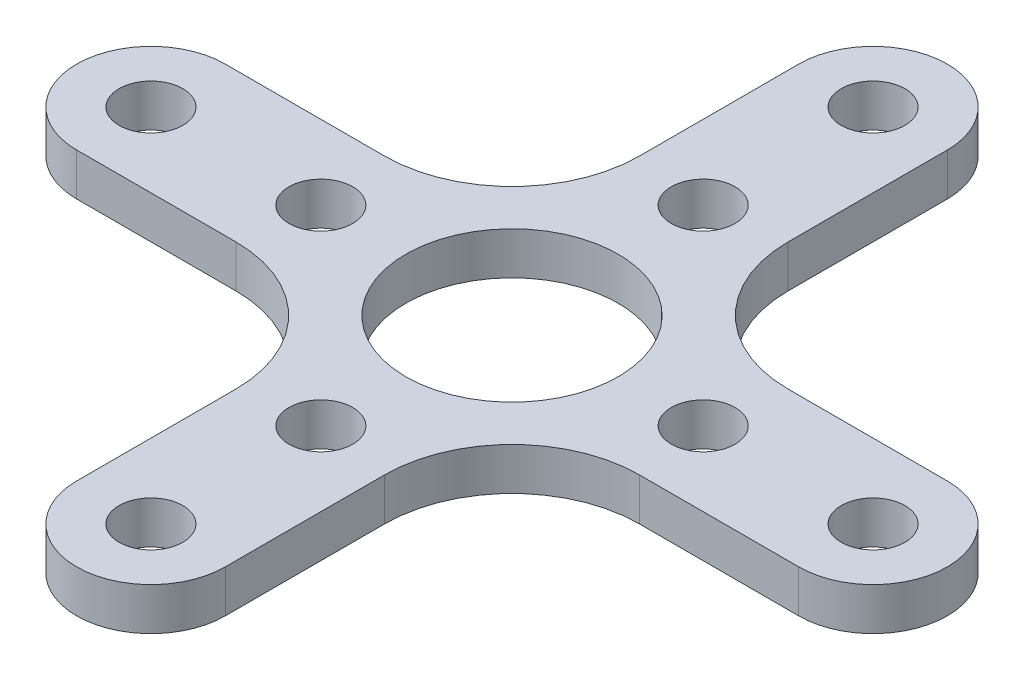
ISO-10303-21;
HEADER;
FILE_DESCRIPTION(('STEP AP214'),'2;1');
FILE_NAME('part.step','',(''),(''),'','','');
FILE_SCHEMA(('AUTOMOTIVE_DESIGN { 1 0 10303 214 1 1 1 1 }'));
ENDSEC;
DATA;
#1=APPLICATION_CONTEXT('core data for automotive mechanical design processes');
#2=APPLICATION_PROTOCOL_DEFINITION('international standard','automotive_design',2000,#1);
#3=PRODUCT_CONTEXT('',#1,'mechanical');
#4=PRODUCT('Part','Part','',(#3));
#5=PRODUCT_RELATED_PRODUCT_CATEGORY('part','',(#4));
#6=PRODUCT_DEFINITION_FORMATION('','',#4);
#7=PRODUCT_DEFINITION_CONTEXT('part definition',#1,'design');
#8=PRODUCT_DEFINITION('design','',#6,#7);
#9=PRODUCT_DEFINITION_SHAPE('','',#8);
#10=(LENGTH_UNIT() NAMED_UNIT(*) SI_UNIT(.MILLI.,.METRE.));
#11=(NAMED_UNIT(*) PLANE_ANGLE_UNIT() SI_UNIT($,.RADIAN.));
#12=(NAMED_UNIT(*) SI_UNIT($,.STERADIAN.) SOLID_ANGLE_UNIT());
#13=UNCERTAINTY_MEASURE_WITH_UNIT(LENGTH_MEASURE(1.E-05),#10,'distance_accuracy_value','');
#14=(GEOMETRIC_REPRESENTATION_CONTEXT(3) GLOBAL_UNCERTAINTY_ASSIGNED_CONTEXT((#13)) GLOBAL_UNIT_ASSIGNED_CONTEXT((#10,
#11,#12)) REPRESENTATION_CONTEXT('',''));
#15=CARTESIAN_POINT('',(0.,0.,0.));
#16=DIRECTION('',(0.,0.,1.));
#17=DIRECTION('',(1.,0.,0.));
#18=AXIS2_PLACEMENT_3D('',#15,#16,#17);
#19=CARTESIAN_POINT('',(17.,2.,0.));
#20=DIRECTION('',(0.,-1.,0.));
#21=DIRECTION('',(0.,0.,-1.));
#22=AXIS2_PLACEMENT_3D('',#19,#20,#21);
#23=CYLINDRICAL_SURFACE('',#22,3.5);
#24=CARTESIAN_POINT('',(17.,0.,0.));
#25=DIRECTION('',(0.,1.,0.));
#26=DIRECTION('',(0.,0.,-1.));
#27=AXIS2_PLACEMENT_3D('',#24,#25,#26);
#28=CIRCLE('',#27,3.5);
#29=CARTESIAN_POINT('',(17.,0.,3.5));
#30=VERTEX_POINT('',#29);
#31=CARTESIAN_POINT('',(17.,0.,-3.5));
#32=VERTEX_POINT('',#31);
#33=EDGE_CURVE('E188',#30,#32,#28,.T.);
#34=ORIENTED_EDGE('',*,*,#33,.T.);
#35=DIRECTION('',(0.,-1.,0.));
#36=VECTOR('',#35,1.);
#37=CARTESIAN_POINT('',(17.,2.,-3.5));
#38=LINE('',#37,#36);
#39=CARTESIAN_POINT('',(17.,2.,-3.5));
#40=VERTEX_POINT('',#39);
#41=EDGE_CURVE('E11',#40,#32,#38,.T.);
#42=ORIENTED_EDGE('',*,*,#41,.F.);
#43=CARTESIAN_POINT('',(17.,2.,0.));
#44=DIRECTION('',(0.,1.,0.));
#45=DIRECTION('',(0.,0.,-1.));
#46=AXIS2_PLACEMENT_3D('',#43,#44,#45);
#47=CIRCLE('',#46,3.5);
#48=CARTESIAN_POINT('',(17.,2.,3.5));
#49=VERTEX_POINT('',#48);
#50=EDGE_CURVE('E219',#49,#40,#47,.T.);
#51=ORIENTED_EDGE('',*,*,#50,.F.);
#52=DIRECTION('',(0.,-1.,0.));
#53=VECTOR('',#52,1.);
#54=CARTESIAN_POINT('',(17.,2.,3.5));
#55=LINE('',#54,#53);
#56=EDGE_CURVE('E184',#49,#30,#55,.T.);
#57=ORIENTED_EDGE('',*,*,#56,.T.);
#58=EDGE_LOOP('',(#34,#42,#51,#57));
#59=FACE_BOUND('',#58,.T.);
#60=ADVANCED_FACE('F44',(#59),#23,.T.);
#61=CARTESIAN_POINT('',(9.50000000000003,2.,-3.49999999999997));
#62=DIRECTION('',(0.,0.,1.));
#63=DIRECTION('',(1.,0.,0.));
#64=AXIS2_PLACEMENT_3D('',#61,#62,#63);
#65=PLANE('',#64);
#66=DIRECTION('',(-1.,0.,0.));
#67=VECTOR('',#66,1.);
#68=CARTESIAN_POINT('',(9.50000000000003,0.,-3.49999999999997));
#69=LINE('',#68,#67);
#70=CARTESIAN_POINT('',(9.50000000000003,0.,-3.49999999999997));
#71=VERTEX_POINT('',#70);
#72=EDGE_CURVE('E191',#32,#71,#69,.T.);
#73=ORIENTED_EDGE('',*,*,#72,.T.);
#74=DIRECTION('',(0.,-1.,0.));
#75=VECTOR('',#74,1.);
#76=CARTESIAN_POINT('',(9.50000000000003,2.,-3.49999999999997));
#77=LINE('',#76,#75);
#78=CARTESIAN_POINT('',(9.50000000000003,2.,-3.49999999999997));
#79=VERTEX_POINT('',#78);
#80=EDGE_CURVE('E52',#79,#71,#77,.T.);
#81=ORIENTED_EDGE('',*,*,#80,.F.);
#82=DIRECTION('',(-1.,0.,0.));
#83=VECTOR('',#82,1.);
#84=CARTESIAN_POINT('',(9.50000000000003,2.,-3.49999999999997));
#85=LINE('',#84,#83);
#86=EDGE_CURVE('E127',#40,#79,#85,.T.);
#87=ORIENTED_EDGE('',*,*,#86,.F.);
#88=ORIENTED_EDGE('',*,*,#41,.T.);
#89=EDGE_LOOP('',(#73,#81,#87,#88));
#90=FACE_BOUND('',#89,.T.);
#91=ADVANCED_FACE('F318',(#90),#65,.F.);
#92=CARTESIAN_POINT('',(9.50000000000004,2.,-9.49999999999998));
#93=DIRECTION('',(0.,-1.,0.));
#94=DIRECTION('',(0.,0.,-1.));
#95=AXIS2_PLACEMENT_3D('',#92,#93,#94);
#96=CYLINDRICAL_SURFACE('',#95,6.00000000000001);
#97=CARTESIAN_POINT('',(9.50000000000004,0.,-9.49999999999998));
#98=DIRECTION('',(0.,-1.,0.));
#99=DIRECTION('',(0.,0.,1.));
#100=AXIS2_PLACEMENT_3D('',#97,#98,#99);
#101=CIRCLE('',#100,6.00000000000001);
#102=CARTESIAN_POINT('',(3.50000000000003,0.,-9.49999999999999));
#103=VERTEX_POINT('',#102);
#104=EDGE_CURVE('E194',#71,#103,#101,.T.);
#105=ORIENTED_EDGE('',*,*,#104,.T.);
#106=DIRECTION('',(0.,-1.,0.));
#107=VECTOR('',#106,1.);
#108=CARTESIAN_POINT('',(3.50000000000003,2.,-9.49999999999999));
#109=LINE('',#108,#107);
#110=CARTESIAN_POINT('',(3.50000000000003,2.,-9.49999999999999));
#111=VERTEX_POINT('',#110);
#112=EDGE_CURVE('E250',#111,#103,#109,.T.);
#113=ORIENTED_EDGE('',*,*,#112,.F.);
#114=CARTESIAN_POINT('',(9.50000000000004,2.,-9.49999999999998));
#115=DIRECTION('',(0.,-1.,0.));
#116=DIRECTION('',(0.,0.,1.));
#117=AXIS2_PLACEMENT_3D('',#114,#115,#116);
#118=CIRCLE('',#117,6.00000000000001);
#119=EDGE_CURVE('E258',#79,#111,#118,.T.);
#120=ORIENTED_EDGE('',*,*,#119,.F.);
#121=ORIENTED_EDGE('',*,*,#80,.T.);
#122=EDGE_LOOP('',(#105,#113,#120,#121));
#123=FACE_BOUND('',#122,.T.);
#124=ADVANCED_FACE('F256',(#123),#96,.F.);
#125=CARTESIAN_POINT('',(3.49999999999999,2.,-17.));
#126=DIRECTION('',(-1.,0.,0.));
#127=DIRECTION('',(0.,0.,1.));
#128=AXIS2_PLACEMENT_3D('',#125,#126,#127);
#129=PLANE('',#128);
#130=DIRECTION('',(0.,0.,-1.));
#131=VECTOR('',#130,1.);
#132=CARTESIAN_POINT('',(3.49999999999999,0.,-17.));
#133=LINE('',#132,#131);
#134=CARTESIAN_POINT('',(3.49999999999999,0.,-17.));
#135=VERTEX_POINT('',#134);
#136=EDGE_CURVE('E196',#103,#135,#133,.T.);
#137=ORIENTED_EDGE('',*,*,#136,.T.);
#138=DIRECTION('',(0.,-1.,0.));
#139=VECTOR('',#138,1.);
#140=CARTESIAN_POINT('',(3.49999999999999,2.,-17.));
#141=LINE('',#140,#139);
#142=CARTESIAN_POINT('',(3.49999999999999,2.,-17.));
#143=VERTEX_POINT('',#142);
#144=EDGE_CURVE('E247',#143,#135,#141,.T.);
#145=ORIENTED_EDGE('',*,*,#144,.F.);
#146=DIRECTION('',(0.,0.,-1.));
#147=VECTOR('',#146,1.);
#148=CARTESIAN_POINT('',(3.49999999999999,2.,-17.));
#149=LINE('',#148,#147);
#150=EDGE_CURVE('E276',#111,#143,#149,.T.);
#151=ORIENTED_EDGE('',*,*,#150,.F.);
#152=ORIENTED_EDGE('',*,*,#112,.T.);
#153=EDGE_LOOP('',(#137,#145,#151,#152));
#154=FACE_BOUND('',#153,.T.);
#155=ADVANCED_FACE('F267',(#154),#129,.F.);
#156=CARTESIAN_POINT('',(0.,2.,-17.));
#157=DIRECTION('',(0.,-1.,0.));
#158=DIRECTION('',(0.,0.,-1.));
#159=AXIS2_PLACEMENT_3D('',#156,#157,#158);
#160=CYLINDRICAL_SURFACE('',#159,3.5);
#161=CARTESIAN_POINT('',(0.,0.,-17.));
#162=DIRECTION('',(0.,1.,0.));
#163=DIRECTION('',(0.,0.,-1.));
#164=AXIS2_PLACEMENT_3D('',#161,#162,#163);
#165=CIRCLE('',#164,3.5);
#166=CARTESIAN_POINT('',(-3.5,0.,-17.));
#167=VERTEX_POINT('',#166);
#168=EDGE_CURVE('E198',#135,#167,#165,.T.);
#169=ORIENTED_EDGE('',*,*,#168,.T.);
#170=DIRECTION('',(0.,-1.,0.));
#171=VECTOR('',#170,1.);
#172=CARTESIAN_POINT('',(-3.5,2.,-17.));
#173=LINE('',#172,#171);
#174=CARTESIAN_POINT('',(-3.5,2.,-17.));
#175=VERTEX_POINT('',#174);
#176=EDGE_CURVE('E244',#175,#167,#173,.T.);
#177=ORIENTED_EDGE('',*,*,#176,.F.);
#178=CARTESIAN_POINT('',(0.,2.,-17.));
#179=DIRECTION('',(0.,1.,0.));
#180=DIRECTION('',(0.,0.,-1.));
#181=AXIS2_PLACEMENT_3D('',#178,#179,#180);
#182=CIRCLE('',#181,3.5);
#183=EDGE_CURVE('E273',#143,#175,#182,.T.);
#184=ORIENTED_EDGE('',*,*,#183,.F.);
#185=ORIENTED_EDGE('',*,*,#144,.T.);
#186=EDGE_LOOP('',(#169,#177,#184,#185));
#187=FACE_BOUND('',#186,.T.);
#188=ADVANCED_FACE('F271',(#187),#160,.T.);
#189=CARTESIAN_POINT('',(-3.5,2.,-17.));
#190=DIRECTION('',(1.,0.,0.));
#191=DIRECTION('',(0.,0.,-1.));
#192=AXIS2_PLACEMENT_3D('',#189,#190,#191);
#193=PLANE('',#192);
#194=DIRECTION('',(0.,0.,1.));
#195=VECTOR('',#194,1.);
#196=CARTESIAN_POINT('',(-3.5,0.,-17.));
#197=LINE('',#196,#195);
#198=CARTESIAN_POINT('',(-3.5,0.,-9.50000000000002));
#199=VERTEX_POINT('',#198);
#200=EDGE_CURVE('E200',#167,#199,#197,.T.);
#201=ORIENTED_EDGE('',*,*,#200,.T.);
#202=DIRECTION('',(0.,-1.,0.));
#203=VECTOR('',#202,1.);
#204=CARTESIAN_POINT('',(-3.5,2.,-9.50000000000002));
#205=LINE('',#204,#203);
#206=CARTESIAN_POINT('',(-3.5,2.,-9.50000000000002));
#207=VERTEX_POINT('',#206);
#208=EDGE_CURVE('E241',#207,#199,#205,.T.);
#209=ORIENTED_EDGE('',*,*,#208,.F.);
#210=DIRECTION('',(0.,0.,1.));
#211=VECTOR('',#210,1.);
#212=CARTESIAN_POINT('',(-3.5,2.,-17.));
#213=LINE('',#212,#211);
#214=EDGE_CURVE('E275',#175,#207,#213,.T.);
#215=ORIENTED_EDGE('',*,*,#214,.F.);
#216=ORIENTED_EDGE('',*,*,#176,.T.);
#217=EDGE_LOOP('',(#201,#209,#215,#216));
#218=FACE_BOUND('',#217,.T.);
#219=ADVANCED_FACE('F331',(#218),#193,.F.);
#220=CARTESIAN_POINT('',(-9.50000000000001,2.,-9.50000000000001));
#221=DIRECTION('',(0.,-1.,0.));
#222=DIRECTION('',(0.,0.,-1.));
#223=AXIS2_PLACEMENT_3D('',#220,#221,#222);
#224=CYLINDRICAL_SURFACE('',#223,6.00000000000001);
#225=CARTESIAN_POINT('',(-9.50000000000001,0.,-9.50000000000001));
#226=DIRECTION('',(0.,-1.,0.));
#227=DIRECTION('',(0.,0.,1.));
#228=AXIS2_PLACEMENT_3D('',#225,#226,#227);
#229=CIRCLE('',#228,6.00000000000001);
#230=CARTESIAN_POINT('',(-9.5,0.,-3.5));
#231=VERTEX_POINT('',#230);
#232=EDGE_CURVE('E202',#199,#231,#229,.T.);
#233=ORIENTED_EDGE('',*,*,#232,.T.);
#234=DIRECTION('',(0.,-1.,0.));
#235=VECTOR('',#234,1.);
#236=CARTESIAN_POINT('',(-9.5,2.,-3.5));
#237=LINE('',#236,#235);
#238=CARTESIAN_POINT('',(-9.5,2.,-3.5));
#239=VERTEX_POINT('',#238);
#240=EDGE_CURVE('E238',#239,#231,#237,.T.);
#241=ORIENTED_EDGE('',*,*,#240,.F.);
#242=CARTESIAN_POINT('',(-9.50000000000001,2.,-9.50000000000001));
#243=DIRECTION('',(0.,-1.,0.));
#244=DIRECTION('',(0.,0.,1.));
#245=AXIS2_PLACEMENT_3D('',#242,#243,#244);
#246=CIRCLE('',#245,6.00000000000001);
#247=EDGE_CURVE('E278',#207,#239,#246,.T.);
#248=ORIENTED_EDGE('',*,*,#247,.F.);
#249=ORIENTED_EDGE('',*,*,#208,.T.);
#250=EDGE_LOOP('',(#233,#241,#248,#249));
#251=FACE_BOUND('',#250,.T.);
#252=ADVANCED_FACE('F334',(#251),#224,.F.);
#253=CARTESIAN_POINT('',(-17.,2.,-3.5));
#254=DIRECTION('',(0.,0.,1.));
#255=DIRECTION('',(1.,0.,0.));
#256=AXIS2_PLACEMENT_3D('',#253,#254,#255);
#257=PLANE('',#256);
#258=DIRECTION('',(-1.,0.,0.));
#259=VECTOR('',#258,1.);
#260=CARTESIAN_POINT('',(-17.,0.,-3.5));
#261=LINE('',#260,#259);
#262=CARTESIAN_POINT('',(-17.,0.,-3.5));
#263=VERTEX_POINT('',#262);
#264=EDGE_CURVE('E204',#231,#263,#261,.T.);
#265=ORIENTED_EDGE('',*,*,#264,.T.);
#266=DIRECTION('',(0.,-1.,0.));
#267=VECTOR('',#266,1.);
#268=CARTESIAN_POINT('',(-17.,2.,-3.5));
#269=LINE('',#268,#267);
#270=CARTESIAN_POINT('',(-17.,2.,-3.5));
#271=VERTEX_POINT('',#270);
#272=EDGE_CURVE('E235',#271,#263,#269,.T.);
#273=ORIENTED_EDGE('',*,*,#272,.F.);
#274=DIRECTION('',(-1.,0.,0.));
#275=VECTOR('',#274,1.);
#276=CARTESIAN_POINT('',(-17.,2.,-3.5));
#277=LINE('',#276,#275);
#278=EDGE_CURVE('E284',#239,#271,#277,.T.);
#279=ORIENTED_EDGE('',*,*,#278,.F.);
#280=ORIENTED_EDGE('',*,*,#240,.T.);
#281=EDGE_LOOP('',(#265,#273,#279,#280));
#282=FACE_BOUND('',#281,.T.);
#283=ADVANCED_FACE('F338',(#282),#257,.F.);
#284=CARTESIAN_POINT('',(-17.,2.,0.));
#285=DIRECTION('',(0.,-1.,0.));
#286=DIRECTION('',(0.,0.,-1.));
#287=AXIS2_PLACEMENT_3D('',#284,#285,#286);
#288=CYLINDRICAL_SURFACE('',#287,3.5);
#289=CARTESIAN_POINT('',(-17.,0.,0.));
#290=DIRECTION('',(0.,1.,0.));
#291=DIRECTION('',(0.,0.,1.));
#292=AXIS2_PLACEMENT_3D('',#289,#290,#291);
#293=CIRCLE('',#292,3.5);
#294=CARTESIAN_POINT('',(-17.,0.,3.5));
#295=VERTEX_POINT('',#294);
#296=EDGE_CURVE('E206',#263,#295,#293,.T.);
#297=ORIENTED_EDGE('',*,*,#296,.T.);
#298=DIRECTION('',(0.,-1.,0.));
#299=VECTOR('',#298,1.);
#300=CARTESIAN_POINT('',(-17.,2.,3.5));
#301=LINE('',#300,#299);
#302=CARTESIAN_POINT('',(-17.,2.,3.5));
#303=VERTEX_POINT('',#302);
#304=EDGE_CURVE('E232',#303,#295,#301,.T.);
#305=ORIENTED_EDGE('',*,*,#304,.F.);
#306=CARTESIAN_POINT('',(-17.,2.,0.));
#307=DIRECTION('',(0.,1.,0.));
#308=DIRECTION('',(0.,0.,1.));
#309=AXIS2_PLACEMENT_3D('',#306,#307,#308);
#310=CIRCLE('',#309,3.5);
#311=EDGE_CURVE('E286',#271,#303,#310,.T.);
#312=ORIENTED_EDGE('',*,*,#311,.F.);
#313=ORIENTED_EDGE('',*,*,#272,.T.);
#314=EDGE_LOOP('',(#297,#305,#312,#313));
#315=FACE_BOUND('',#314,.T.);
#316=ADVANCED_FACE('F342',(#315),#288,.T.);
#317=CARTESIAN_POINT('',(-9.50000000000006,2.,3.4999999999999));
#318=DIRECTION('',(0.,0.,-1.));
#319=DIRECTION('',(-1.,0.,0.));
#320=AXIS2_PLACEMENT_3D('',#317,#318,#319);
#321=PLANE('',#320);
#322=DIRECTION('',(1.,0.,0.));
#323=VECTOR('',#322,1.);
#324=CARTESIAN_POINT('',(-9.50000000000006,0.,3.4999999999999));
#325=LINE('',#324,#323);
#326=CARTESIAN_POINT('',(-9.50000000000006,0.,3.4999999999999));
#327=VERTEX_POINT('',#326);
#328=EDGE_CURVE('E208',#295,#327,#325,.T.);
#329=ORIENTED_EDGE('',*,*,#328,.T.);
#330=DIRECTION('',(0.,-1.,0.));
#331=VECTOR('',#330,1.);
#332=CARTESIAN_POINT('',(-9.50000000000006,2.,3.4999999999999));
#333=LINE('',#332,#331);
#334=CARTESIAN_POINT('',(-9.50000000000006,2.,3.4999999999999));
#335=VERTEX_POINT('',#334);
#336=EDGE_CURVE('E229',#335,#327,#333,.T.);
#337=ORIENTED_EDGE('',*,*,#336,.F.);
#338=DIRECTION('',(1.,0.,0.));
#339=VECTOR('',#338,1.);
#340=CARTESIAN_POINT('',(-9.50000000000006,2.,3.4999999999999));
#341=LINE('',#340,#339);
#342=EDGE_CURVE('E288',#303,#335,#341,.T.);
#343=ORIENTED_EDGE('',*,*,#342,.F.);
#344=ORIENTED_EDGE('',*,*,#304,.T.);
#345=EDGE_LOOP('',(#329,#337,#343,#344));
#346=FACE_BOUND('',#345,.T.);
#347=ADVANCED_FACE('F346',(#346),#321,.F.);
#348=CARTESIAN_POINT('',(-9.49999999999964,2.,9.49999999999984));
#349=DIRECTION('',(0.,-1.,0.));
#350=DIRECTION('',(0.,0.,-1.));
#351=AXIS2_PLACEMENT_3D('',#348,#349,#350);
#352=CYLINDRICAL_SURFACE('',#351,5.99999999999997);
#353=CARTESIAN_POINT('',(-9.49999999999964,0.,9.49999999999984));
#354=DIRECTION('',(0.,-1.,0.));
#355=DIRECTION('',(0.,0.,1.));
#356=AXIS2_PLACEMENT_3D('',#353,#354,#355);
#357=CIRCLE('',#356,5.99999999999997);
#358=CARTESIAN_POINT('',(-3.49999999999966,0.,9.49999999999983));
#359=VERTEX_POINT('',#358);
#360=EDGE_CURVE('E210',#327,#359,#357,.T.);
#361=ORIENTED_EDGE('',*,*,#360,.T.);
#362=DIRECTION('',(0.,-1.,0.));
#363=VECTOR('',#362,1.);
#364=CARTESIAN_POINT('',(-3.49999999999966,2.,9.49999999999983));
#365=LINE('',#364,#363);
#366=CARTESIAN_POINT('',(-3.49999999999966,2.,9.49999999999983));
#367=VERTEX_POINT('',#366);
#368=EDGE_CURVE('E226',#367,#359,#365,.T.);
#369=ORIENTED_EDGE('',*,*,#368,.F.);
#370=CARTESIAN_POINT('',(-9.49999999999964,2.,9.49999999999984));
#371=DIRECTION('',(0.,-1.,0.));
#372=DIRECTION('',(0.,0.,1.));
#373=AXIS2_PLACEMENT_3D('',#370,#371,#372);
#374=CIRCLE('',#373,5.99999999999997);
#375=EDGE_CURVE('E290',#335,#367,#374,.T.);
#376=ORIENTED_EDGE('',*,*,#375,.F.);
#377=ORIENTED_EDGE('',*,*,#336,.T.);
#378=EDGE_LOOP('',(#361,#369,#376,#377));
#379=FACE_BOUND('',#378,.T.);
#380=ADVANCED_FACE('F350',(#379),#352,.F.);
#381=CARTESIAN_POINT('',(-3.49999999999999,2.,17.));
#382=DIRECTION('',(1.,0.,0.));
#383=DIRECTION('',(0.,0.,-1.));
#384=AXIS2_PLACEMENT_3D('',#381,#382,#383);
#385=PLANE('',#384);
#386=DIRECTION('',(0.,0.,1.));
#387=VECTOR('',#386,1.);
#388=CARTESIAN_POINT('',(-3.49999999999999,0.,17.));
#389=LINE('',#388,#387);
#390=CARTESIAN_POINT('',(-3.49999999999999,0.,17.));
#391=VERTEX_POINT('',#390);
#392=EDGE_CURVE('E212',#359,#391,#389,.T.);
#393=ORIENTED_EDGE('',*,*,#392,.T.);
#394=DIRECTION('',(0.,-1.,0.));
#395=VECTOR('',#394,1.);
#396=CARTESIAN_POINT('',(-3.49999999999999,2.,17.));
#397=LINE('',#396,#395);
#398=CARTESIAN_POINT('',(-3.49999999999999,2.,17.));
#399=VERTEX_POINT('',#398);
#400=EDGE_CURVE('E223',#399,#391,#397,.T.);
#401=ORIENTED_EDGE('',*,*,#400,.F.);
#402=DIRECTION('',(0.,0.,1.));
#403=VECTOR('',#402,1.);
#404=CARTESIAN_POINT('',(-3.49999999999999,2.,17.));
#405=LINE('',#404,#403);
#406=EDGE_CURVE('E292',#367,#399,#405,.T.);
#407=ORIENTED_EDGE('',*,*,#406,.F.);
#408=ORIENTED_EDGE('',*,*,#368,.T.);
#409=EDGE_LOOP('',(#393,#401,#407,#408));
#410=FACE_BOUND('',#409,.T.);
#411=ADVANCED_FACE('F298',(#410),#385,.F.);
#412=CARTESIAN_POINT('',(0.,2.,17.));
#413=DIRECTION('',(0.,-1.,0.));
#414=DIRECTION('',(0.,0.,-1.));
#415=AXIS2_PLACEMENT_3D('',#412,#413,#414);
#416=CYLINDRICAL_SURFACE('',#415,3.49999999999999);
#417=CARTESIAN_POINT('',(0.,0.,17.));
#418=DIRECTION('',(0.,1.,0.));
#419=DIRECTION('',(0.,0.,1.));
#420=AXIS2_PLACEMENT_3D('',#417,#418,#419);
#421=CIRCLE('',#420,3.49999999999999);
#422=CARTESIAN_POINT('',(3.49999999999999,0.,17.));
#423=VERTEX_POINT('',#422);
#424=EDGE_CURVE('E214',#391,#423,#421,.T.);
#425=ORIENTED_EDGE('',*,*,#424,.T.);
#426=DIRECTION('',(0.,-1.,0.));
#427=VECTOR('',#426,1.);
#428=CARTESIAN_POINT('',(3.49999999999999,2.,17.));
#429=LINE('',#428,#427);
#430=CARTESIAN_POINT('',(3.49999999999999,2.,17.));
#431=VERTEX_POINT('',#430);
#432=EDGE_CURVE('E179',#431,#423,#429,.T.);
#433=ORIENTED_EDGE('',*,*,#432,.F.);
#434=CARTESIAN_POINT('',(0.,2.,17.));
#435=DIRECTION('',(0.,1.,0.));
#436=DIRECTION('',(0.,0.,1.));
#437=AXIS2_PLACEMENT_3D('',#434,#435,#436);
#438=CIRCLE('',#437,3.49999999999999);
#439=EDGE_CURVE('E170',#399,#431,#438,.T.);
#440=ORIENTED_EDGE('',*,*,#439,.F.);
#441=ORIENTED_EDGE('',*,*,#400,.T.);
#442=EDGE_LOOP('',(#425,#433,#440,#441));
#443=FACE_BOUND('',#442,.T.);
#444=ADVANCED_FACE('F302',(#443),#416,.T.);
#445=CARTESIAN_POINT('',(3.5,2.,9.50000000000002));
#446=DIRECTION('',(-1.,0.,0.));
#447=DIRECTION('',(0.,0.,1.));
#448=AXIS2_PLACEMENT_3D('',#445,#446,#447);
#449=PLANE('',#448);
#450=DIRECTION('',(0.,0.,-1.));
#451=VECTOR('',#450,1.);
#452=CARTESIAN_POINT('',(3.5,0.,9.50000000000002));
#453=LINE('',#452,#451);
#454=CARTESIAN_POINT('',(3.5,0.,9.50000000000002));
#455=VERTEX_POINT('',#454);
#456=EDGE_CURVE('E178',#423,#455,#453,.T.);
#457=ORIENTED_EDGE('',*,*,#456,.T.);
#458=DIRECTION('',(0.,-1.,0.));
#459=VECTOR('',#458,1.);
#460=CARTESIAN_POINT('',(3.5,2.,9.50000000000002));
#461=LINE('',#460,#459);
#462=CARTESIAN_POINT('',(3.5,2.,9.50000000000002));
#463=VERTEX_POINT('',#462);
#464=EDGE_CURVE('E175',#463,#455,#461,.T.);
#465=ORIENTED_EDGE('',*,*,#464,.F.);
#466=DIRECTION('',(0.,0.,-1.));
#467=VECTOR('',#466,1.);
#468=CARTESIAN_POINT('',(3.5,2.,9.50000000000002));
#469=LINE('',#468,#467);
#470=EDGE_CURVE('E164',#431,#463,#469,.T.);
#471=ORIENTED_EDGE('',*,*,#470,.F.);
#472=ORIENTED_EDGE('',*,*,#432,.T.);
#473=EDGE_LOOP('',(#457,#465,#471,#472));
#474=FACE_BOUND('',#473,.T.);
#475=ADVANCED_FACE('F176',(#474),#449,.F.);
#476=CARTESIAN_POINT('',(9.50000000000002,2.,9.50000000000002));
#477=DIRECTION('',(0.,-1.,0.));
#478=DIRECTION('',(0.,0.,-1.));
#479=AXIS2_PLACEMENT_3D('',#476,#477,#478);
#480=CYLINDRICAL_SURFACE('',#479,6.00000000000002);
#481=CARTESIAN_POINT('',(9.50000000000002,0.,9.50000000000002));
#482=DIRECTION('',(0.,-1.,0.));
#483=DIRECTION('',(0.,0.,1.));
#484=AXIS2_PLACEMENT_3D('',#481,#482,#483);
#485=CIRCLE('',#484,6.00000000000002);
#486=CARTESIAN_POINT('',(9.5,0.,3.5));
#487=VERTEX_POINT('',#486);
#488=EDGE_CURVE('E113',#455,#487,#485,.T.);
#489=ORIENTED_EDGE('',*,*,#488,.T.);
#490=DIRECTION('',(0.,-1.,0.));
#491=VECTOR('',#490,1.);
#492=CARTESIAN_POINT('',(9.5,2.,3.5));
#493=LINE('',#492,#491);
#494=CARTESIAN_POINT('',(9.5,2.,3.5));
#495=VERTEX_POINT('',#494);
#496=EDGE_CURVE('E180',#495,#487,#493,.T.);
#497=ORIENTED_EDGE('',*,*,#496,.F.);
#498=CARTESIAN_POINT('',(9.50000000000002,2.,9.50000000000002));
#499=DIRECTION('',(0.,-1.,0.));
#500=DIRECTION('',(0.,0.,1.));
#501=AXIS2_PLACEMENT_3D('',#498,#499,#500);
#502=CIRCLE('',#501,6.00000000000002);
#503=EDGE_CURVE('E168',#463,#495,#502,.T.);
#504=ORIENTED_EDGE('',*,*,#503,.F.);
#505=ORIENTED_EDGE('',*,*,#464,.T.);
#506=EDGE_LOOP('',(#489,#497,#504,#505));
#507=FACE_BOUND('',#506,.T.);
#508=ADVANCED_FACE('F182',(#507),#480,.F.);
#509=CARTESIAN_POINT('',(17.,2.,3.5));
#510=DIRECTION('',(0.,0.,-1.));
#511=DIRECTION('',(-1.,0.,0.));
#512=AXIS2_PLACEMENT_3D('',#509,#510,#511);
#513=PLANE('',#512);
#514=DIRECTION('',(1.,0.,0.));
#515=VECTOR('',#514,1.);
#516=CARTESIAN_POINT('',(17.,0.,3.5));
#517=LINE('',#516,#515);
#518=EDGE_CURVE('E119',#487,#30,#517,.T.);
#519=ORIENTED_EDGE('',*,*,#518,.T.);
#520=ORIENTED_EDGE('',*,*,#56,.F.);
#521=DIRECTION('',(1.,0.,0.));
#522=VECTOR('',#521,1.);
#523=CARTESIAN_POINT('',(17.,2.,3.5));
#524=LINE('',#523,#522);
#525=EDGE_CURVE('E60',#495,#49,#524,.T.);
#526=ORIENTED_EDGE('',*,*,#525,.F.);
#527=ORIENTED_EDGE('',*,*,#496,.T.);
#528=EDGE_LOOP('',(#519,#520,#526,#527));
#529=FACE_BOUND('',#528,.T.);
#530=ADVANCED_FACE('F306',(#529),#513,.F.);
#531=CARTESIAN_POINT('',(17.,2.,0.));
#532=DIRECTION('',(0.,-1.,0.));
#533=DIRECTION('',(0.,0.,-1.));
#534=AXIS2_PLACEMENT_3D('',#531,#532,#533);
#535=PLANE('',#534);
#536=CARTESIAN_POINT('',(0.,2.,-17.));
#537=DIRECTION('',(0.,1.,0.));
#538=DIRECTION('',(0.,0.,1.));
#539=AXIS2_PLACEMENT_3D('',#536,#537,#538);
#540=CIRCLE('',#539,1.5);
#541=CARTESIAN_POINT('',(0.,2.,-15.5));
#542=VERTEX_POINT('',#541);
#543=EDGE_CURVE('E667',#542,#542,#540,.T.);
#544=ORIENTED_EDGE('',*,*,#543,.F.);
#545=EDGE_LOOP('',(#544));
#546=FACE_BOUND('',#545,.T.);
#547=CARTESIAN_POINT('',(-9.,2.,0.));
#548=DIRECTION('',(0.,1.,0.));
#549=DIRECTION('',(0.,0.,1.));
#550=AXIS2_PLACEMENT_3D('',#547,#548,#549);
#551=CIRCLE('',#550,1.5);
#552=CARTESIAN_POINT('',(-9.,2.,1.5));
#553=VERTEX_POINT('',#552);
#554=EDGE_CURVE('E694',#553,#553,#551,.T.);
#555=ORIENTED_EDGE('',*,*,#554,.F.);
#556=EDGE_LOOP('',(#555));
#557=FACE_BOUND('',#556,.T.);
#558=CARTESIAN_POINT('',(-17.,2.,0.));
#559=DIRECTION('',(0.,1.,0.));
#560=DIRECTION('',(0.,0.,1.));
#561=AXIS2_PLACEMENT_3D('',#558,#559,#560);
#562=CIRCLE('',#561,1.5);
#563=CARTESIAN_POINT('',(-17.,2.,1.5));
#564=VERTEX_POINT('',#563);
#565=EDGE_CURVE('E688',#564,#564,#562,.T.);
#566=ORIENTED_EDGE('',*,*,#565,.F.);
#567=EDGE_LOOP('',(#566));
#568=FACE_BOUND('',#567,.T.);
#569=CARTESIAN_POINT('',(0.,2.,9.));
#570=DIRECTION('',(0.,1.,0.));
#571=DIRECTION('',(0.,0.,1.));
#572=AXIS2_PLACEMENT_3D('',#569,#570,#571);
#573=CIRCLE('',#572,1.5);
#574=CARTESIAN_POINT('',(0.,2.,10.5));
#575=VERTEX_POINT('',#574);
#576=EDGE_CURVE('E682',#575,#575,#573,.T.);
#577=ORIENTED_EDGE('',*,*,#576,.F.);
#578=EDGE_LOOP('',(#577));
#579=FACE_BOUND('',#578,.T.);
#580=CARTESIAN_POINT('',(0.,2.,17.));
#581=DIRECTION('',(0.,1.,0.));
#582=DIRECTION('',(0.,0.,1.));
#583=AXIS2_PLACEMENT_3D('',#580,#581,#582);
#584=CIRCLE('',#583,1.5);
#585=CARTESIAN_POINT('',(0.,2.,18.5));
#586=VERTEX_POINT('',#585);
#587=EDGE_CURVE('E675',#586,#586,#584,.T.);
#588=ORIENTED_EDGE('',*,*,#587,.F.);
#589=EDGE_LOOP('',(#588));
#590=FACE_BOUND('',#589,.T.);
#591=CARTESIAN_POINT('',(9.,2.,0.));
#592=DIRECTION('',(0.,1.,0.));
#593=DIRECTION('',(0.,0.,1.));
#594=AXIS2_PLACEMENT_3D('',#591,#592,#593);
#595=CIRCLE('',#594,1.5);
#596=CARTESIAN_POINT('',(9.,2.,1.5));
#597=VERTEX_POINT('',#596);
#598=EDGE_CURVE('E714',#597,#597,#595,.T.);
#599=ORIENTED_EDGE('',*,*,#598,.F.);
#600=EDGE_LOOP('',(#599));
#601=FACE_BOUND('',#600,.T.);
#602=CARTESIAN_POINT('',(17.,2.,0.));
#603=DIRECTION('',(0.,1.,0.));
#604=DIRECTION('',(0.,0.,1.));
#605=AXIS2_PLACEMENT_3D('',#602,#603,#604);
#606=CIRCLE('',#605,1.5);
#607=CARTESIAN_POINT('',(17.,2.,1.5));
#608=VERTEX_POINT('',#607);
#609=EDGE_CURVE('E708',#608,#608,#606,.T.);
#610=ORIENTED_EDGE('',*,*,#609,.F.);
#611=EDGE_LOOP('',(#610));
#612=FACE_BOUND('',#611,.T.);
#613=CARTESIAN_POINT('',(0.,2.,0.));
#614=DIRECTION('',(0.,1.,0.));
#615=DIRECTION('',(0.,0.,1.));
#616=AXIS2_PLACEMENT_3D('',#613,#614,#615);
#617=CIRCLE('',#616,5.);
#618=CARTESIAN_POINT('',(0.,2.,5.));
#619=VERTEX_POINT('',#618);
#620=EDGE_CURVE('E702',#619,#619,#617,.T.);
#621=ORIENTED_EDGE('',*,*,#620,.F.);
#622=EDGE_LOOP('',(#621));
#623=FACE_BOUND('',#622,.T.);
#624=CARTESIAN_POINT('',(0.,2.,-9.));
#625=DIRECTION('',(0.,1.,0.));
#626=DIRECTION('',(0.,0.,1.));
#627=AXIS2_PLACEMENT_3D('',#624,#625,#626);
#628=CIRCLE('',#627,1.5);
#629=CARTESIAN_POINT('',(0.,2.,-7.5));
#630=VERTEX_POINT('',#629);
#631=EDGE_CURVE('E668',#630,#630,#628,.T.);
#632=ORIENTED_EDGE('',*,*,#631,.F.);
#633=EDGE_LOOP('',(#632));
#634=FACE_BOUND('',#633,.T.);
#635=ORIENTED_EDGE('',*,*,#50,.T.);
#636=ORIENTED_EDGE('',*,*,#86,.T.);
#637=ORIENTED_EDGE('',*,*,#119,.T.);
#638=ORIENTED_EDGE('',*,*,#150,.T.);
#639=ORIENTED_EDGE('',*,*,#183,.T.);
#640=ORIENTED_EDGE('',*,*,#214,.T.);
#641=ORIENTED_EDGE('',*,*,#247,.T.);
#642=ORIENTED_EDGE('',*,*,#278,.T.);
#643=ORIENTED_EDGE('',*,*,#311,.T.);
#644=ORIENTED_EDGE('',*,*,#342,.T.);
#645=ORIENTED_EDGE('',*,*,#375,.T.);
#646=ORIENTED_EDGE('',*,*,#406,.T.);
#647=ORIENTED_EDGE('',*,*,#439,.T.);
#648=ORIENTED_EDGE('',*,*,#470,.T.);
#649=ORIENTED_EDGE('',*,*,#503,.T.);
#650=ORIENTED_EDGE('',*,*,#525,.T.);
#651=EDGE_LOOP('',(#635,#636,#637,#638,#639,#640,#641,#642,#643,#644,#645,#646,#647,#648,#649,#650));
#652=FACE_BOUND('',#651,.T.);
#653=ADVANCED_FACE('F166',(#546,#557,#568,#579,#590,#601,#612,#623,#634,#652),#535,.F.);
#654=CARTESIAN_POINT('',(17.,0.,0.));
#655=DIRECTION('',(0.,-1.,0.));
#656=DIRECTION('',(0.,0.,-1.));
#657=AXIS2_PLACEMENT_3D('',#654,#655,#656);
#658=PLANE('',#657);
#659=CARTESIAN_POINT('',(0.,0.,-17.));
#660=DIRECTION('',(0.,1.,0.));
#661=DIRECTION('',(0.,0.,1.));
#662=AXIS2_PLACEMENT_3D('',#659,#660,#661);
#663=CIRCLE('',#662,1.5);
#664=CARTESIAN_POINT('',(0.,0.,-15.5));
#665=VERTEX_POINT('',#664);
#666=EDGE_CURVE('E192',#665,#665,#663,.T.);
#667=ORIENTED_EDGE('',*,*,#666,.T.);
#668=EDGE_LOOP('',(#667));
#669=FACE_BOUND('',#668,.T.);
#670=CARTESIAN_POINT('',(-9.,0.,0.));
#671=DIRECTION('',(0.,1.,0.));
#672=DIRECTION('',(0.,0.,1.));
#673=AXIS2_PLACEMENT_3D('',#670,#671,#672);
#674=CIRCLE('',#673,1.5);
#675=CARTESIAN_POINT('',(-9.,0.,1.5));
#676=VERTEX_POINT('',#675);
#677=EDGE_CURVE('E697',#676,#676,#674,.T.);
#678=ORIENTED_EDGE('',*,*,#677,.T.);
#679=EDGE_LOOP('',(#678));
#680=FACE_BOUND('',#679,.T.);
#681=CARTESIAN_POINT('',(-17.,0.,0.));
#682=DIRECTION('',(0.,1.,0.));
#683=DIRECTION('',(0.,0.,1.));
#684=AXIS2_PLACEMENT_3D('',#681,#682,#683);
#685=CIRCLE('',#684,1.5);
#686=CARTESIAN_POINT('',(-17.,0.,1.5));
#687=VERTEX_POINT('',#686);
#688=EDGE_CURVE('E691',#687,#687,#685,.T.);
#689=ORIENTED_EDGE('',*,*,#688,.T.);
#690=EDGE_LOOP('',(#689));
#691=FACE_BOUND('',#690,.T.);
#692=CARTESIAN_POINT('',(0.,0.,9.));
#693=DIRECTION('',(0.,1.,0.));
#694=DIRECTION('',(0.,0.,1.));
#695=AXIS2_PLACEMENT_3D('',#692,#693,#694);
#696=CIRCLE('',#695,1.5);
#697=CARTESIAN_POINT('',(0.,0.,10.5));
#698=VERTEX_POINT('',#697);
#699=EDGE_CURVE('E685',#698,#698,#696,.T.);
#700=ORIENTED_EDGE('',*,*,#699,.T.);
#701=EDGE_LOOP('',(#700));
#702=FACE_BOUND('',#701,.T.);
#703=CARTESIAN_POINT('',(0.,0.,17.));
#704=DIRECTION('',(0.,1.,0.));
#705=DIRECTION('',(0.,0.,1.));
#706=AXIS2_PLACEMENT_3D('',#703,#704,#705);
#707=CIRCLE('',#706,1.5);
#708=CARTESIAN_POINT('',(0.,0.,18.5));
#709=VERTEX_POINT('',#708);
#710=EDGE_CURVE('E679',#709,#709,#707,.T.);
#711=ORIENTED_EDGE('',*,*,#710,.T.);
#712=EDGE_LOOP('',(#711));
#713=FACE_BOUND('',#712,.T.);
#714=CARTESIAN_POINT('',(9.,0.,0.));
#715=DIRECTION('',(0.,1.,0.));
#716=DIRECTION('',(0.,0.,1.));
#717=AXIS2_PLACEMENT_3D('',#714,#715,#716);
#718=CIRCLE('',#717,1.5);
#719=CARTESIAN_POINT('',(9.,0.,1.5));
#720=VERTEX_POINT('',#719);
#721=EDGE_CURVE('E678',#720,#720,#718,.T.);
#722=ORIENTED_EDGE('',*,*,#721,.T.);
#723=EDGE_LOOP('',(#722));
#724=FACE_BOUND('',#723,.T.);
#725=CARTESIAN_POINT('',(17.,0.,0.));
#726=DIRECTION('',(0.,1.,0.));
#727=DIRECTION('',(0.,0.,1.));
#728=AXIS2_PLACEMENT_3D('',#725,#726,#727);
#729=CIRCLE('',#728,1.5);
#730=CARTESIAN_POINT('',(17.,0.,1.5));
#731=VERTEX_POINT('',#730);
#732=EDGE_CURVE('E711',#731,#731,#729,.T.);
#733=ORIENTED_EDGE('',*,*,#732,.T.);
#734=EDGE_LOOP('',(#733));
#735=FACE_BOUND('',#734,.T.);
#736=CARTESIAN_POINT('',(0.,0.,0.));
#737=DIRECTION('',(0.,1.,0.));
#738=DIRECTION('',(0.,0.,1.));
#739=AXIS2_PLACEMENT_3D('',#736,#737,#738);
#740=CIRCLE('',#739,5.);
#741=CARTESIAN_POINT('',(0.,0.,5.));
#742=VERTEX_POINT('',#741);
#743=EDGE_CURVE('E705',#742,#742,#740,.T.);
#744=ORIENTED_EDGE('',*,*,#743,.T.);
#745=EDGE_LOOP('',(#744));
#746=FACE_BOUND('',#745,.T.);
#747=CARTESIAN_POINT('',(0.,0.,-9.));
#748=DIRECTION('',(0.,1.,0.));
#749=DIRECTION('',(0.,0.,1.));
#750=AXIS2_PLACEMENT_3D('',#747,#748,#749);
#751=CIRCLE('',#750,1.5);
#752=CARTESIAN_POINT('',(0.,0.,-7.5));
#753=VERTEX_POINT('',#752);
#754=EDGE_CURVE('E672',#753,#753,#751,.T.);
#755=ORIENTED_EDGE('',*,*,#754,.T.);
#756=EDGE_LOOP('',(#755));
#757=FACE_BOUND('',#756,.T.);
#758=ORIENTED_EDGE('',*,*,#33,.F.);
#759=ORIENTED_EDGE('',*,*,#518,.F.);
#760=ORIENTED_EDGE('',*,*,#488,.F.);
#761=ORIENTED_EDGE('',*,*,#456,.F.);
#762=ORIENTED_EDGE('',*,*,#424,.F.);
#763=ORIENTED_EDGE('',*,*,#392,.F.);
#764=ORIENTED_EDGE('',*,*,#360,.F.);
#765=ORIENTED_EDGE('',*,*,#328,.F.);
#766=ORIENTED_EDGE('',*,*,#296,.F.);
#767=ORIENTED_EDGE('',*,*,#264,.F.);
#768=ORIENTED_EDGE('',*,*,#232,.F.);
#769=ORIENTED_EDGE('',*,*,#200,.F.);
#770=ORIENTED_EDGE('',*,*,#168,.F.);
#771=ORIENTED_EDGE('',*,*,#136,.F.);
#772=ORIENTED_EDGE('',*,*,#104,.F.);
#773=ORIENTED_EDGE('',*,*,#72,.F.);
#774=EDGE_LOOP('',(#758,#759,#760,#761,#762,#763,#764,#765,#766,#767,#768,#769,#770,#771,#772,#773));
#775=FACE_BOUND('',#774,.T.);
#776=ADVANCED_FACE('F262',(#669,#680,#691,#702,#713,#724,#735,#746,#757,#775),#658,.T.);
#777=CARTESIAN_POINT('',(0.,0.,-9.));
#778=DIRECTION('',(0.,1.,0.));
#779=DIRECTION('',(0.,0.,1.));
#780=AXIS2_PLACEMENT_3D('',#777,#778,#779);
#781=CYLINDRICAL_SURFACE('',#780,1.5);
#782=ORIENTED_EDGE('',*,*,#754,.F.);
#783=EDGE_LOOP('',(#782));
#784=FACE_BOUND('',#783,.T.);
#785=ORIENTED_EDGE('',*,*,#631,.T.);
#786=EDGE_LOOP('',(#785));
#787=FACE_BOUND('',#786,.T.);
#788=ADVANCED_FACE('F387',(#784,#787),#781,.F.);
#789=CARTESIAN_POINT('',(0.,0.,0.));
#790=DIRECTION('',(0.,1.,0.));
#791=DIRECTION('',(0.,0.,1.));
#792=AXIS2_PLACEMENT_3D('',#789,#790,#791);
#793=CYLINDRICAL_SURFACE('',#792,5.);
#794=ORIENTED_EDGE('',*,*,#743,.F.);
#795=EDGE_LOOP('',(#794));
#796=FACE_BOUND('',#795,.T.);
#797=ORIENTED_EDGE('',*,*,#620,.T.);
#798=EDGE_LOOP('',(#797));
#799=FACE_BOUND('',#798,.T.);
#800=ADVANCED_FACE('F396',(#796,#799),#793,.F.);
#801=CARTESIAN_POINT('',(17.,0.,0.));
#802=DIRECTION('',(0.,1.,0.));
#803=DIRECTION('',(0.,0.,1.));
#804=AXIS2_PLACEMENT_3D('',#801,#802,#803);
#805=CYLINDRICAL_SURFACE('',#804,1.5);
#806=ORIENTED_EDGE('',*,*,#732,.F.);
#807=EDGE_LOOP('',(#806));
#808=FACE_BOUND('',#807,.T.);
#809=ORIENTED_EDGE('',*,*,#609,.T.);
#810=EDGE_LOOP('',(#809));
#811=FACE_BOUND('',#810,.T.);
#812=ADVANCED_FACE('F406',(#808,#811),#805,.F.);
#813=CARTESIAN_POINT('',(9.,0.,0.));
#814=DIRECTION('',(0.,1.,0.));
#815=DIRECTION('',(0.,0.,1.));
#816=AXIS2_PLACEMENT_3D('',#813,#814,#815);
#817=CYLINDRICAL_SURFACE('',#816,1.5);
#818=ORIENTED_EDGE('',*,*,#721,.F.);
#819=EDGE_LOOP('',(#818));
#820=FACE_BOUND('',#819,.T.);
#821=ORIENTED_EDGE('',*,*,#598,.T.);
#822=EDGE_LOOP('',(#821));
#823=FACE_BOUND('',#822,.T.);
#824=ADVANCED_FACE('F416',(#820,#823),#817,.F.);
#825=CARTESIAN_POINT('',(0.,0.,17.));
#826=DIRECTION('',(0.,1.,0.));
#827=DIRECTION('',(0.,0.,1.));
#828=AXIS2_PLACEMENT_3D('',#825,#826,#827);
#829=CYLINDRICAL_SURFACE('',#828,1.5);
#830=ORIENTED_EDGE('',*,*,#710,.F.);
#831=EDGE_LOOP('',(#830));
#832=FACE_BOUND('',#831,.T.);
#833=ORIENTED_EDGE('',*,*,#587,.T.);
#834=EDGE_LOOP('',(#833));
#835=FACE_BOUND('',#834,.T.);
#836=ADVANCED_FACE('F426',(#832,#835),#829,.F.);
#837=CARTESIAN_POINT('',(0.,0.,9.));
#838=DIRECTION('',(0.,1.,0.));
#839=DIRECTION('',(0.,0.,1.));
#840=AXIS2_PLACEMENT_3D('',#837,#838,#839);
#841=CYLINDRICAL_SURFACE('',#840,1.5);
#842=ORIENTED_EDGE('',*,*,#699,.F.);
#843=EDGE_LOOP('',(#842));
#844=FACE_BOUND('',#843,.T.);
#845=ORIENTED_EDGE('',*,*,#576,.T.);
#846=EDGE_LOOP('',(#845));
#847=FACE_BOUND('',#846,.T.);
#848=ADVANCED_FACE('F436',(#844,#847),#841,.F.);
#849=CARTESIAN_POINT('',(-17.,0.,0.));
#850=DIRECTION('',(0.,1.,0.));
#851=DIRECTION('',(0.,0.,1.));
#852=AXIS2_PLACEMENT_3D('',#849,#850,#851);
#853=CYLINDRICAL_SURFACE('',#852,1.5);
#854=ORIENTED_EDGE('',*,*,#688,.F.);
#855=EDGE_LOOP('',(#854));
#856=FACE_BOUND('',#855,.T.);
#857=ORIENTED_EDGE('',*,*,#565,.T.);
#858=EDGE_LOOP('',(#857));
#859=FACE_BOUND('',#858,.T.);
#860=ADVANCED_FACE('F446',(#856,#859),#853,.F.);
#861=CARTESIAN_POINT('',(-9.,0.,0.));
#862=DIRECTION('',(0.,1.,0.));
#863=DIRECTION('',(0.,0.,1.));
#864=AXIS2_PLACEMENT_3D('',#861,#862,#863);
#865=CYLINDRICAL_SURFACE('',#864,1.5);
#866=ORIENTED_EDGE('',*,*,#677,.F.);
#867=EDGE_LOOP('',(#866));
#868=FACE_BOUND('',#867,.T.);
#869=ORIENTED_EDGE('',*,*,#554,.T.);
#870=EDGE_LOOP('',(#869));
#871=FACE_BOUND('',#870,.T.);
#872=ADVANCED_FACE('F456',(#868,#871),#865,.F.);
#873=CARTESIAN_POINT('',(0.,0.,-17.));
#874=DIRECTION('',(0.,1.,0.));
#875=DIRECTION('',(0.,0.,1.));
#876=AXIS2_PLACEMENT_3D('',#873,#874,#875);
#877=CYLINDRICAL_SURFACE('',#876,1.5);
#878=ORIENTED_EDGE('',*,*,#666,.F.);
#879=EDGE_LOOP('',(#878));
#880=FACE_BOUND('',#879,.T.);
#881=ORIENTED_EDGE('',*,*,#543,.T.);
#882=EDGE_LOOP('',(#881));
#883=FACE_BOUND('',#882,.T.);
#884=ADVANCED_FACE('F466',(#880,#883),#877,.F.);
#885=CLOSED_SHELL('',(#60,#91,#124,#155,#188,#219,#252,#283,#316,#347,#380,#411,#444,#475,#508,
#530,#653,#776,#788,#800,#812,#824,#836,#848,#860,#872,#884));
#886=MANIFOLD_SOLID_BREP('B2',#885);
#887=ADVANCED_BREP_SHAPE_REPRESENTATION('',(#18,#886),#14);
#888=SHAPE_DEFINITION_REPRESENTATION(#9,#887);
ENDSEC;
END-ISO-10303-21;
